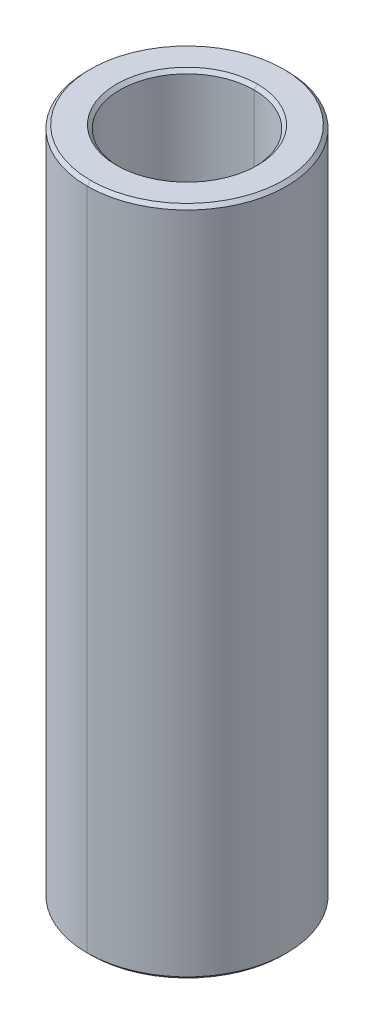
ISO-10303-21;
HEADER;
FILE_DESCRIPTION(('STEP AP214'),'2;1');
FILE_NAME('part.step','',(''),(''),'','','');
FILE_SCHEMA(('AUTOMOTIVE_DESIGN { 1 0 10303 214 1 1 1 1 }'));
ENDSEC;
DATA;
#1=APPLICATION_CONTEXT('core data for automotive mechanical design processes');
#2=APPLICATION_PROTOCOL_DEFINITION('international standard','automotive_design',2000,#1);
#3=PRODUCT_CONTEXT('',#1,'mechanical');
#4=PRODUCT('Part','Part','',(#3));
#5=PRODUCT_RELATED_PRODUCT_CATEGORY('part','',(#4));
#6=PRODUCT_DEFINITION_FORMATION('','',#4);
#7=PRODUCT_DEFINITION_CONTEXT('part definition',#1,'design');
#8=PRODUCT_DEFINITION('design','',#6,#7);
#9=PRODUCT_DEFINITION_SHAPE('','',#8);
#10=(LENGTH_UNIT() NAMED_UNIT(*) SI_UNIT(.MILLI.,.METRE.));
#11=(NAMED_UNIT(*) PLANE_ANGLE_UNIT() SI_UNIT($,.RADIAN.));
#12=(NAMED_UNIT(*) SI_UNIT($,.STERADIAN.) SOLID_ANGLE_UNIT());
#13=UNCERTAINTY_MEASURE_WITH_UNIT(LENGTH_MEASURE(1.E-05),#10,'distance_accuracy_value','');
#14=(GEOMETRIC_REPRESENTATION_CONTEXT(3) GLOBAL_UNCERTAINTY_ASSIGNED_CONTEXT((#13)) GLOBAL_UNIT_ASSIGNED_CONTEXT((#10,
#11,#12)) REPRESENTATION_CONTEXT('',''));
#15=CARTESIAN_POINT('',(0.,0.,0.));
#16=DIRECTION('',(0.,0.,1.));
#17=DIRECTION('',(1.,0.,0.));
#18=AXIS2_PLACEMENT_3D('',#15,#16,#17);
#19=CARTESIAN_POINT('',(0.,9.9,0.));
#20=DIRECTION('',(0.,1.,0.));
#21=DIRECTION('',(0.,0.,1.));
#22=AXIS2_PLACEMENT_3D('',#19,#20,#21);
#23=CONICAL_SURFACE('',#22,2.,0.785398163397448);
#24=DIRECTION('',(0.,0.707106781186548,-0.707106781186548));
#25=VECTOR('',#24,1.);
#26=CARTESIAN_POINT('',(0.,9.9,-2.));
#27=LINE('',#26,#25);
#28=CARTESIAN_POINT('',(0.,9.9,-2.));
#29=VERTEX_POINT('',#28);
#30=CARTESIAN_POINT('',(0.,10.,-2.1));
#31=VERTEX_POINT('',#30);
#32=EDGE_CURVE('E205',#29,#31,#27,.T.);
#33=ORIENTED_EDGE('',*,*,#32,.F.);
#34=CARTESIAN_POINT('',(0.,9.9,0.));
#35=DIRECTION('',(0.,1.,0.));
#36=DIRECTION('',(0.,0.,1.));
#37=AXIS2_PLACEMENT_3D('',#34,#35,#36);
#38=CIRCLE('',#37,2.);
#39=CARTESIAN_POINT('',(0.,9.9,2.));
#40=VERTEX_POINT('',#39);
#41=EDGE_CURVE('E26',#40,#29,#38,.T.);
#42=ORIENTED_EDGE('',*,*,#41,.F.);
#43=DIRECTION('',(0.,0.707106781186548,0.707106781186548));
#44=VECTOR('',#43,1.);
#45=CARTESIAN_POINT('',(0.,9.9,2.));
#46=LINE('',#45,#44);
#47=CARTESIAN_POINT('',(0.,10.,2.1));
#48=VERTEX_POINT('',#47);
#49=EDGE_CURVE('E145',#40,#48,#46,.T.);
#50=ORIENTED_EDGE('',*,*,#49,.T.);
#51=CARTESIAN_POINT('',(0.,10.,0.));
#52=DIRECTION('',(0.,-1.,0.));
#53=DIRECTION('',(0.,0.,1.));
#54=AXIS2_PLACEMENT_3D('',#51,#52,#53);
#55=CIRCLE('',#54,2.1);
#56=EDGE_CURVE('E120',#31,#48,#55,.T.);
#57=ORIENTED_EDGE('',*,*,#56,.F.);
#58=EDGE_LOOP('',(#33,#42,#50,#57));
#59=FACE_BOUND('',#58,.T.);
#60=ADVANCED_FACE('F15',(#59),#23,.F.);
#61=CARTESIAN_POINT('',(0.,-10.,0.));
#62=DIRECTION('',(0.,-1.,0.));
#63=DIRECTION('',(0.,0.,-1.));
#64=AXIS2_PLACEMENT_3D('',#61,#62,#63);
#65=CONICAL_SURFACE('',#64,2.1,0.785398163397448);
#66=DIRECTION('',(0.,-0.707106781186548,0.707106781186548));
#67=VECTOR('',#66,1.);
#68=CARTESIAN_POINT('',(0.,-10.,2.1));
#69=LINE('',#68,#67);
#70=CARTESIAN_POINT('',(0.,-9.9,2.));
#71=VERTEX_POINT('',#70);
#72=CARTESIAN_POINT('',(0.,-10.,2.1));
#73=VERTEX_POINT('',#72);
#74=EDGE_CURVE('E129',#71,#73,#69,.T.);
#75=ORIENTED_EDGE('',*,*,#74,.F.);
#76=CARTESIAN_POINT('',(0.,-9.9,0.));
#77=DIRECTION('',(0.,-1.,0.));
#78=DIRECTION('',(0.,0.,1.));
#79=AXIS2_PLACEMENT_3D('',#76,#77,#78);
#80=CIRCLE('',#79,2.);
#81=CARTESIAN_POINT('',(0.,-9.9,-2.));
#82=VERTEX_POINT('',#81);
#83=EDGE_CURVE('E10',#82,#71,#80,.T.);
#84=ORIENTED_EDGE('',*,*,#83,.F.);
#85=DIRECTION('',(0.,-0.707106781186548,-0.707106781186548));
#86=VECTOR('',#85,1.);
#87=CARTESIAN_POINT('',(0.,-10.,-2.1));
#88=LINE('',#87,#86);
#89=CARTESIAN_POINT('',(0.,-10.,-2.1));
#90=VERTEX_POINT('',#89);
#91=EDGE_CURVE('E137',#82,#90,#88,.T.);
#92=ORIENTED_EDGE('',*,*,#91,.T.);
#93=CARTESIAN_POINT('',(0.,-10.,0.));
#94=DIRECTION('',(0.,1.,0.));
#95=DIRECTION('',(0.,0.,1.));
#96=AXIS2_PLACEMENT_3D('',#93,#94,#95);
#97=CIRCLE('',#96,2.1);
#98=EDGE_CURVE('E78',#73,#90,#97,.T.);
#99=ORIENTED_EDGE('',*,*,#98,.F.);
#100=EDGE_LOOP('',(#75,#84,#92,#99));
#101=FACE_BOUND('',#100,.T.);
#102=ADVANCED_FACE('F260',(#101),#65,.F.);
#103=CARTESIAN_POINT('',(0.,10.,0.));
#104=DIRECTION('',(0.,-1.,0.));
#105=DIRECTION('',(0.,0.,-1.));
#106=AXIS2_PLACEMENT_3D('',#103,#104,#105);
#107=CONICAL_SURFACE('',#106,2.875,0.78539816339744);
#108=DIRECTION('',(0.,-0.707106781186554,0.707106781186542));
#109=VECTOR('',#108,1.);
#110=CARTESIAN_POINT('',(0.,10.,2.875));
#111=LINE('',#110,#109);
#112=CARTESIAN_POINT('',(0.,10.,2.875));
#113=VERTEX_POINT('',#112);
#114=CARTESIAN_POINT('',(0.,9.9,2.975));
#115=VERTEX_POINT('',#114);
#116=EDGE_CURVE('E103',#113,#115,#111,.T.);
#117=ORIENTED_EDGE('',*,*,#116,.F.);
#118=CARTESIAN_POINT('',(0.,10.,0.));
#119=DIRECTION('',(0.,1.,0.));
#120=DIRECTION('',(0.,0.,1.));
#121=AXIS2_PLACEMENT_3D('',#118,#119,#120);
#122=CIRCLE('',#121,2.875);
#123=CARTESIAN_POINT('',(0.,10.,-2.875));
#124=VERTEX_POINT('',#123);
#125=EDGE_CURVE('E89',#124,#113,#122,.T.);
#126=ORIENTED_EDGE('',*,*,#125,.F.);
#127=DIRECTION('',(0.,-0.707106781186554,-0.707106781186542));
#128=VECTOR('',#127,1.);
#129=CARTESIAN_POINT('',(0.,10.,-2.875));
#130=LINE('',#129,#128);
#131=CARTESIAN_POINT('',(0.,9.9,-2.975));
#132=VERTEX_POINT('',#131);
#133=EDGE_CURVE('E93',#124,#132,#130,.T.);
#134=ORIENTED_EDGE('',*,*,#133,.T.);
#135=CARTESIAN_POINT('',(0.,9.9,0.));
#136=DIRECTION('',(0.,-1.,0.));
#137=DIRECTION('',(0.,0.,1.));
#138=AXIS2_PLACEMENT_3D('',#135,#136,#137);
#139=CIRCLE('',#138,2.975);
#140=EDGE_CURVE('E67',#115,#132,#139,.T.);
#141=ORIENTED_EDGE('',*,*,#140,.F.);
#142=EDGE_LOOP('',(#117,#126,#134,#141));
#143=FACE_BOUND('',#142,.T.);
#144=ADVANCED_FACE('F94',(#143),#107,.T.);
#145=CARTESIAN_POINT('',(0.,-9.9,0.));
#146=DIRECTION('',(0.,1.,0.));
#147=DIRECTION('',(0.,0.,1.));
#148=AXIS2_PLACEMENT_3D('',#145,#146,#147);
#149=CONICAL_SURFACE('',#148,2.975,0.78539816339744);
#150=DIRECTION('',(0.,0.707106781186554,-0.707106781186542));
#151=VECTOR('',#150,1.);
#152=CARTESIAN_POINT('',(0.,-9.9,-2.975));
#153=LINE('',#152,#151);
#154=CARTESIAN_POINT('',(0.,-10.,-2.875));
#155=VERTEX_POINT('',#154);
#156=CARTESIAN_POINT('',(0.,-9.9,-2.975));
#157=VERTEX_POINT('',#156);
#158=EDGE_CURVE('E128',#155,#157,#153,.T.);
#159=ORIENTED_EDGE('',*,*,#158,.F.);
#160=CARTESIAN_POINT('',(0.,-10.,0.));
#161=DIRECTION('',(0.,-1.,0.));
#162=DIRECTION('',(0.,0.,1.));
#163=AXIS2_PLACEMENT_3D('',#160,#161,#162);
#164=CIRCLE('',#163,2.875);
#165=CARTESIAN_POINT('',(0.,-10.,2.875));
#166=VERTEX_POINT('',#165);
#167=EDGE_CURVE('E61',#166,#155,#164,.T.);
#168=ORIENTED_EDGE('',*,*,#167,.F.);
#169=DIRECTION('',(0.,0.707106781186554,0.707106781186542));
#170=VECTOR('',#169,1.);
#171=CARTESIAN_POINT('',(0.,-9.9,2.975));
#172=LINE('',#171,#170);
#173=CARTESIAN_POINT('',(0.,-9.9,2.975));
#174=VERTEX_POINT('',#173);
#175=EDGE_CURVE('E112',#166,#174,#172,.T.);
#176=ORIENTED_EDGE('',*,*,#175,.T.);
#177=CARTESIAN_POINT('',(0.,-9.9,0.));
#178=DIRECTION('',(0.,1.,0.));
#179=DIRECTION('',(0.,0.,1.));
#180=AXIS2_PLACEMENT_3D('',#177,#178,#179);
#181=CIRCLE('',#180,2.975);
#182=EDGE_CURVE('E41',#157,#174,#181,.T.);
#183=ORIENTED_EDGE('',*,*,#182,.F.);
#184=EDGE_LOOP('',(#159,#168,#176,#183));
#185=FACE_BOUND('',#184,.T.);
#186=ADVANCED_FACE('F249',(#185),#149,.T.);
#187=CARTESIAN_POINT('',(0.,10.,0.));
#188=DIRECTION('',(0.,-1.,0.));
#189=DIRECTION('',(0.,0.,-1.));
#190=AXIS2_PLACEMENT_3D('',#187,#188,#189);
#191=CYLINDRICAL_SURFACE('',#190,2.);
#192=DIRECTION('',(0.,-1.,0.));
#193=VECTOR('',#192,1.);
#194=CARTESIAN_POINT('',(0.,10.,2.));
#195=LINE('',#194,#193);
#196=EDGE_CURVE('E116',#40,#71,#195,.T.);
#197=ORIENTED_EDGE('',*,*,#196,.F.);
#198=ORIENTED_EDGE('',*,*,#41,.T.);
#199=DIRECTION('',(0.,-1.,0.));
#200=VECTOR('',#199,1.);
#201=CARTESIAN_POINT('',(0.,10.,-2.));
#202=LINE('',#201,#200);
#203=EDGE_CURVE('E19',#29,#82,#202,.T.);
#204=ORIENTED_EDGE('',*,*,#203,.T.);
#205=ORIENTED_EDGE('',*,*,#83,.T.);
#206=EDGE_LOOP('',(#197,#198,#204,#205));
#207=FACE_BOUND('',#206,.T.);
#208=ADVANCED_FACE('F257',(#207),#191,.F.);
#209=CARTESIAN_POINT('',(0.,10.,0.));
#210=DIRECTION('',(0.,-1.,0.));
#211=DIRECTION('',(0.,0.,-1.));
#212=AXIS2_PLACEMENT_3D('',#209,#210,#211);
#213=CYLINDRICAL_SURFACE('',#212,2.975);
#214=DIRECTION('',(0.,-1.,0.));
#215=VECTOR('',#214,1.);
#216=CARTESIAN_POINT('',(0.,10.,2.975));
#217=LINE('',#216,#215);
#218=EDGE_CURVE('E72',#115,#174,#217,.T.);
#219=ORIENTED_EDGE('',*,*,#218,.F.);
#220=ORIENTED_EDGE('',*,*,#140,.T.);
#221=DIRECTION('',(0.,-1.,0.));
#222=VECTOR('',#221,1.);
#223=CARTESIAN_POINT('',(0.,10.,-2.975));
#224=LINE('',#223,#222);
#225=EDGE_CURVE('E70',#132,#157,#224,.T.);
#226=ORIENTED_EDGE('',*,*,#225,.T.);
#227=ORIENTED_EDGE('',*,*,#182,.T.);
#228=EDGE_LOOP('',(#219,#220,#226,#227));
#229=FACE_BOUND('',#228,.T.);
#230=ADVANCED_FACE('F69',(#229),#213,.T.);
#231=CARTESIAN_POINT('',(0.,-10.,0.));
#232=DIRECTION('',(0.,1.,0.));
#233=DIRECTION('',(1.,0.,0.));
#234=AXIS2_PLACEMENT_3D('',#231,#232,#233);
#235=PLANE('',#234);
#236=CARTESIAN_POINT('',(0.,-10.,0.));
#237=DIRECTION('',(0.,1.,0.));
#238=DIRECTION('',(0.,0.,1.));
#239=AXIS2_PLACEMENT_3D('',#236,#237,#238);
#240=CIRCLE('',#239,2.1);
#241=EDGE_CURVE('E133',#90,#73,#240,.T.);
#242=ORIENTED_EDGE('',*,*,#241,.T.);
#243=ORIENTED_EDGE('',*,*,#98,.T.);
#244=EDGE_LOOP('',(#242,#243));
#245=FACE_BOUND('',#244,.T.);
#246=ORIENTED_EDGE('',*,*,#167,.T.);
#247=CARTESIAN_POINT('',(0.,-10.,0.));
#248=DIRECTION('',(0.,-1.,0.));
#249=DIRECTION('',(0.,0.,1.));
#250=AXIS2_PLACEMENT_3D('',#247,#248,#249);
#251=CIRCLE('',#250,2.875);
#252=EDGE_CURVE('E100',#155,#166,#251,.T.);
#253=ORIENTED_EDGE('',*,*,#252,.T.);
#254=EDGE_LOOP('',(#246,#253));
#255=FACE_BOUND('',#254,.T.);
#256=ADVANCED_FACE('F17',(#245,#255),#235,.F.);
#257=CARTESIAN_POINT('',(0.,10.,0.));
#258=DIRECTION('',(0.,1.,0.));
#259=DIRECTION('',(1.,0.,0.));
#260=AXIS2_PLACEMENT_3D('',#257,#258,#259);
#261=PLANE('',#260);
#262=CARTESIAN_POINT('',(0.,10.,0.));
#263=DIRECTION('',(0.,-1.,0.));
#264=DIRECTION('',(0.,0.,1.));
#265=AXIS2_PLACEMENT_3D('',#262,#263,#264);
#266=CIRCLE('',#265,2.1);
#267=EDGE_CURVE('E210',#48,#31,#266,.T.);
#268=ORIENTED_EDGE('',*,*,#267,.T.);
#269=ORIENTED_EDGE('',*,*,#56,.T.);
#270=EDGE_LOOP('',(#268,#269));
#271=FACE_BOUND('',#270,.T.);
#272=ORIENTED_EDGE('',*,*,#125,.T.);
#273=CARTESIAN_POINT('',(0.,10.,0.));
#274=DIRECTION('',(0.,1.,0.));
#275=DIRECTION('',(0.,0.,1.));
#276=AXIS2_PLACEMENT_3D('',#273,#274,#275);
#277=CIRCLE('',#276,2.875);
#278=EDGE_CURVE('E109',#113,#124,#277,.T.);
#279=ORIENTED_EDGE('',*,*,#278,.T.);
#280=EDGE_LOOP('',(#272,#279));
#281=FACE_BOUND('',#280,.T.);
#282=ADVANCED_FACE('F154',(#271,#281),#261,.T.);
#283=CARTESIAN_POINT('',(0.,10.,0.));
#284=DIRECTION('',(0.,-1.,0.));
#285=DIRECTION('',(0.,0.,-1.));
#286=AXIS2_PLACEMENT_3D('',#283,#284,#285);
#287=CYLINDRICAL_SURFACE('',#286,2.975);
#288=CARTESIAN_POINT('',(0.,9.9,0.));
#289=DIRECTION('',(0.,-1.,0.));
#290=DIRECTION('',(0.,0.,1.));
#291=AXIS2_PLACEMENT_3D('',#288,#289,#290);
#292=CIRCLE('',#291,2.975);
#293=EDGE_CURVE('E83',#132,#115,#292,.T.);
#294=ORIENTED_EDGE('',*,*,#293,.T.);
#295=ORIENTED_EDGE('',*,*,#218,.T.);
#296=CARTESIAN_POINT('',(0.,-9.9,0.));
#297=DIRECTION('',(0.,1.,0.));
#298=DIRECTION('',(0.,0.,1.));
#299=AXIS2_PLACEMENT_3D('',#296,#297,#298);
#300=CIRCLE('',#299,2.975);
#301=EDGE_CURVE('E86',#174,#157,#300,.T.);
#302=ORIENTED_EDGE('',*,*,#301,.T.);
#303=ORIENTED_EDGE('',*,*,#225,.F.);
#304=EDGE_LOOP('',(#294,#295,#302,#303));
#305=FACE_BOUND('',#304,.T.);
#306=ADVANCED_FACE('F81',(#305),#287,.T.);
#307=CARTESIAN_POINT('',(0.,10.,0.));
#308=DIRECTION('',(0.,-1.,0.));
#309=DIRECTION('',(0.,0.,-1.));
#310=AXIS2_PLACEMENT_3D('',#307,#308,#309);
#311=CYLINDRICAL_SURFACE('',#310,2.);
#312=CARTESIAN_POINT('',(0.,9.9,0.));
#313=DIRECTION('',(0.,1.,0.));
#314=DIRECTION('',(0.,0.,1.));
#315=AXIS2_PLACEMENT_3D('',#312,#313,#314);
#316=CIRCLE('',#315,2.);
#317=EDGE_CURVE('E216',#29,#40,#316,.T.);
#318=ORIENTED_EDGE('',*,*,#317,.T.);
#319=ORIENTED_EDGE('',*,*,#196,.T.);
#320=CARTESIAN_POINT('',(0.,-9.9,0.));
#321=DIRECTION('',(0.,-1.,0.));
#322=DIRECTION('',(0.,0.,1.));
#323=AXIS2_PLACEMENT_3D('',#320,#321,#322);
#324=CIRCLE('',#323,2.);
#325=EDGE_CURVE('E134',#71,#82,#324,.T.);
#326=ORIENTED_EDGE('',*,*,#325,.T.);
#327=ORIENTED_EDGE('',*,*,#203,.F.);
#328=EDGE_LOOP('',(#318,#319,#326,#327));
#329=FACE_BOUND('',#328,.T.);
#330=ADVANCED_FACE('F270',(#329),#311,.F.);
#331=CARTESIAN_POINT('',(0.,-9.9,0.));
#332=DIRECTION('',(0.,1.,0.));
#333=DIRECTION('',(0.,0.,1.));
#334=AXIS2_PLACEMENT_3D('',#331,#332,#333);
#335=CONICAL_SURFACE('',#334,2.975,0.78539816339744);
#336=ORIENTED_EDGE('',*,*,#252,.F.);
#337=ORIENTED_EDGE('',*,*,#158,.T.);
#338=ORIENTED_EDGE('',*,*,#301,.F.);
#339=ORIENTED_EDGE('',*,*,#175,.F.);
#340=EDGE_LOOP('',(#336,#337,#338,#339));
#341=FACE_BOUND('',#340,.T.);
#342=ADVANCED_FACE('F246',(#341),#335,.T.);
#343=CARTESIAN_POINT('',(0.,10.,0.));
#344=DIRECTION('',(0.,-1.,0.));
#345=DIRECTION('',(0.,0.,-1.));
#346=AXIS2_PLACEMENT_3D('',#343,#344,#345);
#347=CONICAL_SURFACE('',#346,2.875,0.78539816339744);
#348=ORIENTED_EDGE('',*,*,#278,.F.);
#349=ORIENTED_EDGE('',*,*,#116,.T.);
#350=ORIENTED_EDGE('',*,*,#293,.F.);
#351=ORIENTED_EDGE('',*,*,#133,.F.);
#352=EDGE_LOOP('',(#348,#349,#350,#351));
#353=FACE_BOUND('',#352,.T.);
#354=ADVANCED_FACE('F102',(#353),#347,.T.);
#355=CARTESIAN_POINT('',(0.,-10.,0.));
#356=DIRECTION('',(0.,-1.,0.));
#357=DIRECTION('',(0.,0.,-1.));
#358=AXIS2_PLACEMENT_3D('',#355,#356,#357);
#359=CONICAL_SURFACE('',#358,2.1,0.785398163397448);
#360=ORIENTED_EDGE('',*,*,#325,.F.);
#361=ORIENTED_EDGE('',*,*,#74,.T.);
#362=ORIENTED_EDGE('',*,*,#241,.F.);
#363=ORIENTED_EDGE('',*,*,#91,.F.);
#364=EDGE_LOOP('',(#360,#361,#362,#363));
#365=FACE_BOUND('',#364,.T.);
#366=ADVANCED_FACE('F268',(#365),#359,.F.);
#367=CARTESIAN_POINT('',(0.,9.9,0.));
#368=DIRECTION('',(0.,1.,0.));
#369=DIRECTION('',(0.,0.,1.));
#370=AXIS2_PLACEMENT_3D('',#367,#368,#369);
#371=CONICAL_SURFACE('',#370,2.,0.785398163397448);
#372=ORIENTED_EDGE('',*,*,#317,.F.);
#373=ORIENTED_EDGE('',*,*,#32,.T.);
#374=ORIENTED_EDGE('',*,*,#267,.F.);
#375=ORIENTED_EDGE('',*,*,#49,.F.);
#376=EDGE_LOOP('',(#372,#373,#374,#375));
#377=FACE_BOUND('',#376,.T.);
#378=ADVANCED_FACE('F214',(#377),#371,.F.);
#379=CLOSED_SHELL('',(#60,#102,#144,#186,#208,#230,#256,#282,#306,#330,#342,#354,#366,#378));
#380=MANIFOLD_SOLID_BREP('B1',#379);
#381=ADVANCED_BREP_SHAPE_REPRESENTATION('',(#18,#380),#14);
#382=SHAPE_DEFINITION_REPRESENTATION(#9,#381);
ENDSEC;
END-ISO-10303-21;
